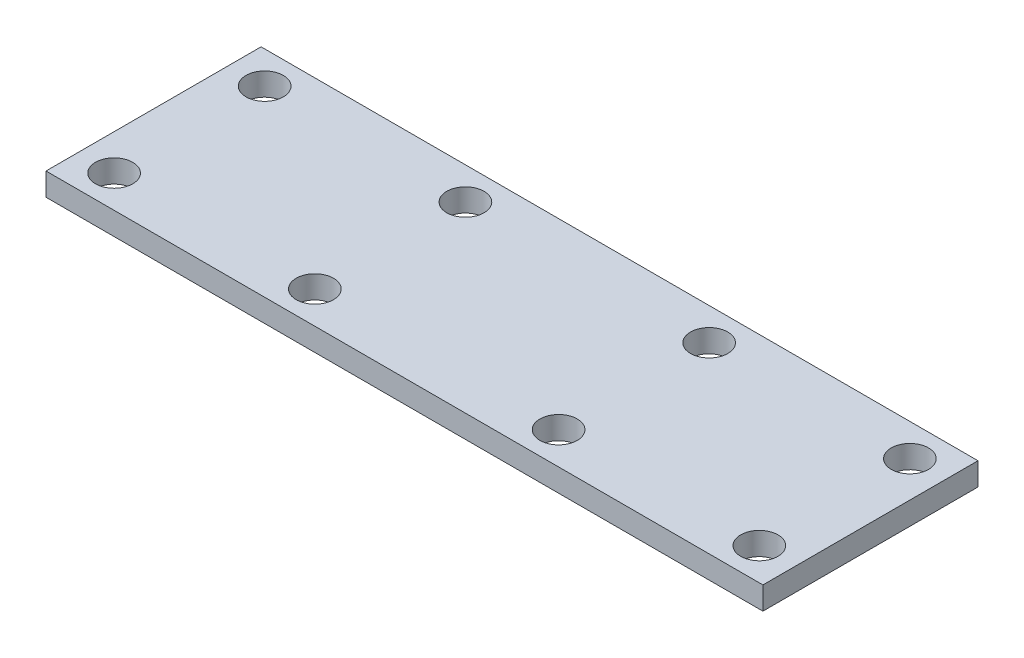
ISO-10303-21;
HEADER;
FILE_DESCRIPTION(('STEP AP214'),'2;1');
FILE_NAME('part.step','',(''),(''),'','','');
FILE_SCHEMA(('AUTOMOTIVE_DESIGN { 1 0 10303 214 1 1 1 1 }'));
ENDSEC;
DATA;
#1=APPLICATION_CONTEXT('core data for automotive mechanical design processes');
#2=APPLICATION_PROTOCOL_DEFINITION('international standard','automotive_design',2000,#1);
#3=PRODUCT_CONTEXT('',#1,'mechanical');
#4=PRODUCT('Part','Part','',(#3));
#5=PRODUCT_RELATED_PRODUCT_CATEGORY('part','',(#4));
#6=PRODUCT_DEFINITION_FORMATION('','',#4);
#7=PRODUCT_DEFINITION_CONTEXT('part definition',#1,'design');
#8=PRODUCT_DEFINITION('design','',#6,#7);
#9=PRODUCT_DEFINITION_SHAPE('','',#8);
#10=(LENGTH_UNIT() NAMED_UNIT(*) SI_UNIT(.MILLI.,.METRE.));
#11=(NAMED_UNIT(*) PLANE_ANGLE_UNIT() SI_UNIT($,.RADIAN.));
#12=(NAMED_UNIT(*) SI_UNIT($,.STERADIAN.) SOLID_ANGLE_UNIT());
#13=UNCERTAINTY_MEASURE_WITH_UNIT(LENGTH_MEASURE(1.E-05),#10,'distance_accuracy_value','');
#14=(GEOMETRIC_REPRESENTATION_CONTEXT(3) GLOBAL_UNCERTAINTY_ASSIGNED_CONTEXT((#13)) GLOBAL_UNIT_ASSIGNED_CONTEXT((#10,
#11,#12)) REPRESENTATION_CONTEXT('',''));
#15=CARTESIAN_POINT('',(0.,0.,0.));
#16=DIRECTION('',(0.,0.,1.));
#17=DIRECTION('',(1.,0.,0.));
#18=AXIS2_PLACEMENT_3D('',#15,#16,#17);
#19=CARTESIAN_POINT('',(0.,3.175,0.));
#20=DIRECTION('',(0.,1.,0.));
#21=DIRECTION('',(0.,0.,1.));
#22=AXIS2_PLACEMENT_3D('',#19,#20,#21);
#23=PLANE('',#22);
#24=CARTESIAN_POINT('',(45.,3.175,10.5));
#25=DIRECTION('',(0.,1.,0.));
#26=DIRECTION('',(0.,0.,1.));
#27=AXIS2_PLACEMENT_3D('',#24,#25,#26);
#28=CIRCLE('',#27,2.6);
#29=CARTESIAN_POINT('',(45.,3.175,13.1));
#30=VERTEX_POINT('',#29);
#31=EDGE_CURVE('E145',#30,#30,#28,.T.);
#32=ORIENTED_EDGE('',*,*,#31,.F.);
#33=EDGE_LOOP('',(#32));
#34=FACE_BOUND('',#33,.T.);
#35=CARTESIAN_POINT('',(-45.,3.175,-10.5));
#36=DIRECTION('',(0.,1.,0.));
#37=DIRECTION('',(0.,0.,1.));
#38=AXIS2_PLACEMENT_3D('',#35,#36,#37);
#39=CIRCLE('',#38,2.6);
#40=CARTESIAN_POINT('',(-45.,3.175,-7.9));
#41=VERTEX_POINT('',#40);
#42=EDGE_CURVE('E133',#41,#41,#39,.T.);
#43=ORIENTED_EDGE('',*,*,#42,.F.);
#44=EDGE_LOOP('',(#43));
#45=FACE_BOUND('',#44,.T.);
#46=CARTESIAN_POINT('',(17.,3.175,10.5));
#47=DIRECTION('',(0.,1.,0.));
#48=DIRECTION('',(0.,0.,1.));
#49=AXIS2_PLACEMENT_3D('',#46,#47,#48);
#50=CIRCLE('',#49,2.6);
#51=CARTESIAN_POINT('',(17.,3.175,13.1));
#52=VERTEX_POINT('',#51);
#53=EDGE_CURVE('E121',#52,#52,#50,.T.);
#54=ORIENTED_EDGE('',*,*,#53,.F.);
#55=EDGE_LOOP('',(#54));
#56=FACE_BOUND('',#55,.T.);
#57=CARTESIAN_POINT('',(-17.,3.175,-10.5));
#58=DIRECTION('',(0.,1.,0.));
#59=DIRECTION('',(0.,0.,1.));
#60=AXIS2_PLACEMENT_3D('',#57,#58,#59);
#61=CIRCLE('',#60,2.6);
#62=CARTESIAN_POINT('',(-17.,3.175,-7.9));
#63=VERTEX_POINT('',#62);
#64=EDGE_CURVE('E100',#63,#63,#61,.T.);
#65=ORIENTED_EDGE('',*,*,#64,.F.);
#66=EDGE_LOOP('',(#65));
#67=FACE_BOUND('',#66,.T.);
#68=DIRECTION('',(0.,0.,1.));
#69=VECTOR('',#68,1.);
#70=CARTESIAN_POINT('',(-50.,3.175,15.));
#71=LINE('',#70,#69);
#72=CARTESIAN_POINT('',(-50.,3.175,-15.));
#73=VERTEX_POINT('',#72);
#74=CARTESIAN_POINT('',(-50.,3.175,15.));
#75=VERTEX_POINT('',#74);
#76=EDGE_CURVE('E85',#73,#75,#71,.T.);
#77=ORIENTED_EDGE('',*,*,#76,.T.);
#78=DIRECTION('',(1.,0.,0.));
#79=VECTOR('',#78,1.);
#80=CARTESIAN_POINT('',(50.,3.175,15.));
#81=LINE('',#80,#79);
#82=CARTESIAN_POINT('',(50.,3.175,15.));
#83=VERTEX_POINT('',#82);
#84=EDGE_CURVE('E80',#75,#83,#81,.T.);
#85=ORIENTED_EDGE('',*,*,#84,.T.);
#86=DIRECTION('',(0.,0.,-1.));
#87=VECTOR('',#86,1.);
#88=CARTESIAN_POINT('',(50.,3.175,15.));
#89=LINE('',#88,#87);
#90=CARTESIAN_POINT('',(50.,3.175,-15.));
#91=VERTEX_POINT('',#90);
#92=EDGE_CURVE('E83',#83,#91,#89,.T.);
#93=ORIENTED_EDGE('',*,*,#92,.T.);
#94=DIRECTION('',(-1.,0.,0.));
#95=VECTOR('',#94,1.);
#96=CARTESIAN_POINT('',(50.,3.175,-15.));
#97=LINE('',#96,#95);
#98=EDGE_CURVE('E50',#91,#73,#97,.T.);
#99=ORIENTED_EDGE('',*,*,#98,.T.);
#100=EDGE_LOOP('',(#77,#85,#93,#99));
#101=FACE_BOUND('',#100,.T.);
#102=CARTESIAN_POINT('',(17.,3.175,-10.5));
#103=DIRECTION('',(0.,1.,0.));
#104=DIRECTION('',(0.,0.,-1.));
#105=AXIS2_PLACEMENT_3D('',#102,#103,#104);
#106=CIRCLE('',#105,2.6);
#107=CARTESIAN_POINT('',(17.,3.175,-13.1));
#108=VERTEX_POINT('',#107);
#109=EDGE_CURVE('E115',#108,#108,#106,.T.);
#110=ORIENTED_EDGE('',*,*,#109,.F.);
#111=EDGE_LOOP('',(#110));
#112=FACE_BOUND('',#111,.T.);
#113=CARTESIAN_POINT('',(-17.,3.175,10.5));
#114=DIRECTION('',(0.,1.,0.));
#115=DIRECTION('',(0.,0.,-1.));
#116=AXIS2_PLACEMENT_3D('',#113,#114,#115);
#117=CIRCLE('',#116,2.6);
#118=CARTESIAN_POINT('',(-17.,3.175,7.9));
#119=VERTEX_POINT('',#118);
#120=EDGE_CURVE('E127',#119,#119,#117,.T.);
#121=ORIENTED_EDGE('',*,*,#120,.F.);
#122=EDGE_LOOP('',(#121));
#123=FACE_BOUND('',#122,.T.);
#124=CARTESIAN_POINT('',(45.,3.175,-10.5));
#125=DIRECTION('',(0.,1.,0.));
#126=DIRECTION('',(0.,0.,-1.));
#127=AXIS2_PLACEMENT_3D('',#124,#125,#126);
#128=CIRCLE('',#127,2.6);
#129=CARTESIAN_POINT('',(45.,3.175,-13.1));
#130=VERTEX_POINT('',#129);
#131=EDGE_CURVE('E139',#130,#130,#128,.T.);
#132=ORIENTED_EDGE('',*,*,#131,.F.);
#133=EDGE_LOOP('',(#132));
#134=FACE_BOUND('',#133,.T.);
#135=CARTESIAN_POINT('',(-45.,3.175,10.5));
#136=DIRECTION('',(0.,1.,0.));
#137=DIRECTION('',(0.,0.,-1.));
#138=AXIS2_PLACEMENT_3D('',#135,#136,#137);
#139=CIRCLE('',#138,2.6);
#140=CARTESIAN_POINT('',(-45.,3.175,7.90000000000002));
#141=VERTEX_POINT('',#140);
#142=EDGE_CURVE('E151',#141,#141,#139,.T.);
#143=ORIENTED_EDGE('',*,*,#142,.F.);
#144=EDGE_LOOP('',(#143));
#145=FACE_BOUND('',#144,.T.);
#146=ADVANCED_FACE('F33',(#34,#45,#56,#67,#101,#112,#123,#134,#145),#23,.T.);
#147=CARTESIAN_POINT('',(0.,0.,0.));
#148=DIRECTION('',(0.,1.,0.));
#149=DIRECTION('',(0.,0.,1.));
#150=AXIS2_PLACEMENT_3D('',#147,#148,#149);
#151=PLANE('',#150);
#152=CARTESIAN_POINT('',(45.,0.,10.5));
#153=DIRECTION('',(0.,1.,0.));
#154=DIRECTION('',(0.,0.,1.));
#155=AXIS2_PLACEMENT_3D('',#152,#153,#154);
#156=CIRCLE('',#155,2.6);
#157=CARTESIAN_POINT('',(45.,0.,13.1));
#158=VERTEX_POINT('',#157);
#159=EDGE_CURVE('E148',#158,#158,#156,.T.);
#160=ORIENTED_EDGE('',*,*,#159,.T.);
#161=EDGE_LOOP('',(#160));
#162=FACE_BOUND('',#161,.T.);
#163=CARTESIAN_POINT('',(-45.,0.,-10.5));
#164=DIRECTION('',(0.,1.,0.));
#165=DIRECTION('',(0.,0.,1.));
#166=AXIS2_PLACEMENT_3D('',#163,#164,#165);
#167=CIRCLE('',#166,2.6);
#168=CARTESIAN_POINT('',(-45.,0.,-7.9));
#169=VERTEX_POINT('',#168);
#170=EDGE_CURVE('E136',#169,#169,#167,.T.);
#171=ORIENTED_EDGE('',*,*,#170,.T.);
#172=EDGE_LOOP('',(#171));
#173=FACE_BOUND('',#172,.T.);
#174=CARTESIAN_POINT('',(17.,0.,10.5));
#175=DIRECTION('',(0.,1.,0.));
#176=DIRECTION('',(0.,0.,1.));
#177=AXIS2_PLACEMENT_3D('',#174,#175,#176);
#178=CIRCLE('',#177,2.6);
#179=CARTESIAN_POINT('',(17.,0.,13.1));
#180=VERTEX_POINT('',#179);
#181=EDGE_CURVE('E124',#180,#180,#178,.T.);
#182=ORIENTED_EDGE('',*,*,#181,.T.);
#183=EDGE_LOOP('',(#182));
#184=FACE_BOUND('',#183,.T.);
#185=CARTESIAN_POINT('',(-17.,0.,-10.5));
#186=DIRECTION('',(0.,1.,0.));
#187=DIRECTION('',(0.,0.,1.));
#188=AXIS2_PLACEMENT_3D('',#185,#186,#187);
#189=CIRCLE('',#188,2.6);
#190=CARTESIAN_POINT('',(-17.,0.,-7.9));
#191=VERTEX_POINT('',#190);
#192=EDGE_CURVE('E112',#191,#191,#189,.T.);
#193=ORIENTED_EDGE('',*,*,#192,.T.);
#194=EDGE_LOOP('',(#193));
#195=FACE_BOUND('',#194,.T.);
#196=DIRECTION('',(0.,0.,1.));
#197=VECTOR('',#196,1.);
#198=CARTESIAN_POINT('',(-50.,0.,15.));
#199=LINE('',#198,#197);
#200=CARTESIAN_POINT('',(-50.,0.,-15.));
#201=VERTEX_POINT('',#200);
#202=CARTESIAN_POINT('',(-50.,0.,15.));
#203=VERTEX_POINT('',#202);
#204=EDGE_CURVE('E97',#201,#203,#199,.T.);
#205=ORIENTED_EDGE('',*,*,#204,.F.);
#206=DIRECTION('',(-1.,0.,0.));
#207=VECTOR('',#206,1.);
#208=CARTESIAN_POINT('',(50.,0.,-15.));
#209=LINE('',#208,#207);
#210=CARTESIAN_POINT('',(50.,0.,-15.));
#211=VERTEX_POINT('',#210);
#212=EDGE_CURVE('E73',#211,#201,#209,.T.);
#213=ORIENTED_EDGE('',*,*,#212,.F.);
#214=DIRECTION('',(0.,0.,-1.));
#215=VECTOR('',#214,1.);
#216=CARTESIAN_POINT('',(50.,0.,15.));
#217=LINE('',#216,#215);
#218=CARTESIAN_POINT('',(50.,0.,15.));
#219=VERTEX_POINT('',#218);
#220=EDGE_CURVE('E67',#219,#211,#217,.T.);
#221=ORIENTED_EDGE('',*,*,#220,.F.);
#222=DIRECTION('',(1.,0.,0.));
#223=VECTOR('',#222,1.);
#224=CARTESIAN_POINT('',(50.,0.,15.));
#225=LINE('',#224,#223);
#226=EDGE_CURVE('E89',#203,#219,#225,.T.);
#227=ORIENTED_EDGE('',*,*,#226,.F.);
#228=EDGE_LOOP('',(#205,#213,#221,#227));
#229=FACE_BOUND('',#228,.T.);
#230=CARTESIAN_POINT('',(17.,0.,-10.5));
#231=DIRECTION('',(0.,1.,0.));
#232=DIRECTION('',(0.,0.,-1.));
#233=AXIS2_PLACEMENT_3D('',#230,#231,#232);
#234=CIRCLE('',#233,2.6);
#235=CARTESIAN_POINT('',(17.,0.,-13.1));
#236=VERTEX_POINT('',#235);
#237=EDGE_CURVE('E118',#236,#236,#234,.T.);
#238=ORIENTED_EDGE('',*,*,#237,.T.);
#239=EDGE_LOOP('',(#238));
#240=FACE_BOUND('',#239,.T.);
#241=CARTESIAN_POINT('',(-17.,0.,10.5));
#242=DIRECTION('',(0.,1.,0.));
#243=DIRECTION('',(0.,0.,-1.));
#244=AXIS2_PLACEMENT_3D('',#241,#242,#243);
#245=CIRCLE('',#244,2.6);
#246=CARTESIAN_POINT('',(-17.,0.,7.9));
#247=VERTEX_POINT('',#246);
#248=EDGE_CURVE('E130',#247,#247,#245,.T.);
#249=ORIENTED_EDGE('',*,*,#248,.T.);
#250=EDGE_LOOP('',(#249));
#251=FACE_BOUND('',#250,.T.);
#252=CARTESIAN_POINT('',(45.,0.,-10.5));
#253=DIRECTION('',(0.,1.,0.));
#254=DIRECTION('',(0.,0.,-1.));
#255=AXIS2_PLACEMENT_3D('',#252,#253,#254);
#256=CIRCLE('',#255,2.6);
#257=CARTESIAN_POINT('',(45.,0.,-13.1));
#258=VERTEX_POINT('',#257);
#259=EDGE_CURVE('E142',#258,#258,#256,.T.);
#260=ORIENTED_EDGE('',*,*,#259,.T.);
#261=EDGE_LOOP('',(#260));
#262=FACE_BOUND('',#261,.T.);
#263=CARTESIAN_POINT('',(-45.,0.,10.5));
#264=DIRECTION('',(0.,1.,0.));
#265=DIRECTION('',(0.,0.,-1.));
#266=AXIS2_PLACEMENT_3D('',#263,#264,#265);
#267=CIRCLE('',#266,2.6);
#268=CARTESIAN_POINT('',(-45.,0.,7.90000000000002));
#269=VERTEX_POINT('',#268);
#270=EDGE_CURVE('E154',#269,#269,#267,.T.);
#271=ORIENTED_EDGE('',*,*,#270,.T.);
#272=EDGE_LOOP('',(#271));
#273=FACE_BOUND('',#272,.T.);
#274=ADVANCED_FACE('F108',(#162,#173,#184,#195,#229,#240,#251,#262,#273),#151,.F.);
#275=CARTESIAN_POINT('',(-50.,3.175,15.));
#276=DIRECTION('',(1.,0.,0.));
#277=DIRECTION('',(0.,0.,-1.));
#278=AXIS2_PLACEMENT_3D('',#275,#276,#277);
#279=PLANE('',#278);
#280=ORIENTED_EDGE('',*,*,#204,.T.);
#281=DIRECTION('',(0.,-1.,0.));
#282=VECTOR('',#281,1.);
#283=CARTESIAN_POINT('',(-50.,3.175,15.));
#284=LINE('',#283,#282);
#285=EDGE_CURVE('E11',#75,#203,#284,.T.);
#286=ORIENTED_EDGE('',*,*,#285,.F.);
#287=ORIENTED_EDGE('',*,*,#76,.F.);
#288=DIRECTION('',(0.,-1.,0.));
#289=VECTOR('',#288,1.);
#290=CARTESIAN_POINT('',(-50.,3.175,-15.));
#291=LINE('',#290,#289);
#292=EDGE_CURVE('E93',#73,#201,#291,.T.);
#293=ORIENTED_EDGE('',*,*,#292,.T.);
#294=EDGE_LOOP('',(#280,#286,#287,#293));
#295=FACE_BOUND('',#294,.T.);
#296=ADVANCED_FACE('F35',(#295),#279,.F.);
#297=CARTESIAN_POINT('',(50.,3.175,15.));
#298=DIRECTION('',(0.,0.,-1.));
#299=DIRECTION('',(-1.,0.,0.));
#300=AXIS2_PLACEMENT_3D('',#297,#298,#299);
#301=PLANE('',#300);
#302=ORIENTED_EDGE('',*,*,#226,.T.);
#303=DIRECTION('',(0.,-1.,0.));
#304=VECTOR('',#303,1.);
#305=CARTESIAN_POINT('',(50.,3.175,15.));
#306=LINE('',#305,#304);
#307=EDGE_CURVE('E42',#83,#219,#306,.T.);
#308=ORIENTED_EDGE('',*,*,#307,.F.);
#309=ORIENTED_EDGE('',*,*,#84,.F.);
#310=ORIENTED_EDGE('',*,*,#285,.T.);
#311=EDGE_LOOP('',(#302,#308,#309,#310));
#312=FACE_BOUND('',#311,.T.);
#313=ADVANCED_FACE('F88',(#312),#301,.F.);
#314=CARTESIAN_POINT('',(50.,3.175,15.));
#315=DIRECTION('',(-1.,0.,0.));
#316=DIRECTION('',(0.,0.,1.));
#317=AXIS2_PLACEMENT_3D('',#314,#315,#316);
#318=PLANE('',#317);
#319=ORIENTED_EDGE('',*,*,#220,.T.);
#320=DIRECTION('',(0.,-1.,0.));
#321=VECTOR('',#320,1.);
#322=CARTESIAN_POINT('',(50.,3.175,-15.));
#323=LINE('',#322,#321);
#324=EDGE_CURVE('E90',#91,#211,#323,.T.);
#325=ORIENTED_EDGE('',*,*,#324,.F.);
#326=ORIENTED_EDGE('',*,*,#92,.F.);
#327=ORIENTED_EDGE('',*,*,#307,.T.);
#328=EDGE_LOOP('',(#319,#325,#326,#327));
#329=FACE_BOUND('',#328,.T.);
#330=ADVANCED_FACE('F91',(#329),#318,.F.);
#331=CARTESIAN_POINT('',(50.,3.175,-15.));
#332=DIRECTION('',(0.,0.,1.));
#333=DIRECTION('',(1.,0.,0.));
#334=AXIS2_PLACEMENT_3D('',#331,#332,#333);
#335=PLANE('',#334);
#336=ORIENTED_EDGE('',*,*,#212,.T.);
#337=ORIENTED_EDGE('',*,*,#292,.F.);
#338=ORIENTED_EDGE('',*,*,#98,.F.);
#339=ORIENTED_EDGE('',*,*,#324,.T.);
#340=EDGE_LOOP('',(#336,#337,#338,#339));
#341=FACE_BOUND('',#340,.T.);
#342=ADVANCED_FACE('F105',(#341),#335,.F.);
#343=CARTESIAN_POINT('',(-17.,3.175,-10.5));
#344=DIRECTION('',(0.,-1.,0.));
#345=DIRECTION('',(0.,0.,-1.));
#346=AXIS2_PLACEMENT_3D('',#343,#344,#345);
#347=CYLINDRICAL_SURFACE('',#346,2.6);
#348=ORIENTED_EDGE('',*,*,#64,.T.);
#349=EDGE_LOOP('',(#348));
#350=FACE_BOUND('',#349,.T.);
#351=ORIENTED_EDGE('',*,*,#192,.F.);
#352=EDGE_LOOP('',(#351));
#353=FACE_BOUND('',#352,.T.);
#354=ADVANCED_FACE('F174',(#350,#353),#347,.F.);
#355=CARTESIAN_POINT('',(17.,3.175,-10.5));
#356=DIRECTION('',(0.,-1.,0.));
#357=DIRECTION('',(0.,0.,-1.));
#358=AXIS2_PLACEMENT_3D('',#355,#356,#357);
#359=CYLINDRICAL_SURFACE('',#358,2.6);
#360=ORIENTED_EDGE('',*,*,#109,.T.);
#361=EDGE_LOOP('',(#360));
#362=FACE_BOUND('',#361,.T.);
#363=ORIENTED_EDGE('',*,*,#237,.F.);
#364=EDGE_LOOP('',(#363));
#365=FACE_BOUND('',#364,.T.);
#366=ADVANCED_FACE('F220',(#362,#365),#359,.F.);
#367=CARTESIAN_POINT('',(17.,3.175,10.5));
#368=DIRECTION('',(0.,-1.,0.));
#369=DIRECTION('',(0.,0.,-1.));
#370=AXIS2_PLACEMENT_3D('',#367,#368,#369);
#371=CYLINDRICAL_SURFACE('',#370,2.6);
#372=ORIENTED_EDGE('',*,*,#53,.T.);
#373=EDGE_LOOP('',(#372));
#374=FACE_BOUND('',#373,.T.);
#375=ORIENTED_EDGE('',*,*,#181,.F.);
#376=EDGE_LOOP('',(#375));
#377=FACE_BOUND('',#376,.T.);
#378=ADVANCED_FACE('F228',(#374,#377),#371,.F.);
#379=CARTESIAN_POINT('',(-17.,3.175,10.5));
#380=DIRECTION('',(0.,-1.,0.));
#381=DIRECTION('',(0.,0.,-1.));
#382=AXIS2_PLACEMENT_3D('',#379,#380,#381);
#383=CYLINDRICAL_SURFACE('',#382,2.6);
#384=ORIENTED_EDGE('',*,*,#120,.T.);
#385=EDGE_LOOP('',(#384));
#386=FACE_BOUND('',#385,.T.);
#387=ORIENTED_EDGE('',*,*,#248,.F.);
#388=EDGE_LOOP('',(#387));
#389=FACE_BOUND('',#388,.T.);
#390=ADVANCED_FACE('F236',(#386,#389),#383,.F.);
#391=CARTESIAN_POINT('',(-45.,3.175,-10.5));
#392=DIRECTION('',(0.,-1.,0.));
#393=DIRECTION('',(0.,0.,-1.));
#394=AXIS2_PLACEMENT_3D('',#391,#392,#393);
#395=CYLINDRICAL_SURFACE('',#394,2.6);
#396=ORIENTED_EDGE('',*,*,#42,.T.);
#397=EDGE_LOOP('',(#396));
#398=FACE_BOUND('',#397,.T.);
#399=ORIENTED_EDGE('',*,*,#170,.F.);
#400=EDGE_LOOP('',(#399));
#401=FACE_BOUND('',#400,.T.);
#402=ADVANCED_FACE('F245',(#398,#401),#395,.F.);
#403=CARTESIAN_POINT('',(45.,3.175,-10.5));
#404=DIRECTION('',(0.,-1.,0.));
#405=DIRECTION('',(0.,0.,-1.));
#406=AXIS2_PLACEMENT_3D('',#403,#404,#405);
#407=CYLINDRICAL_SURFACE('',#406,2.6);
#408=ORIENTED_EDGE('',*,*,#131,.T.);
#409=EDGE_LOOP('',(#408));
#410=FACE_BOUND('',#409,.T.);
#411=ORIENTED_EDGE('',*,*,#259,.F.);
#412=EDGE_LOOP('',(#411));
#413=FACE_BOUND('',#412,.T.);
#414=ADVANCED_FACE('F254',(#410,#413),#407,.F.);
#415=CARTESIAN_POINT('',(45.,3.175,10.5));
#416=DIRECTION('',(0.,-1.,0.));
#417=DIRECTION('',(0.,0.,-1.));
#418=AXIS2_PLACEMENT_3D('',#415,#416,#417);
#419=CYLINDRICAL_SURFACE('',#418,2.6);
#420=ORIENTED_EDGE('',*,*,#31,.T.);
#421=EDGE_LOOP('',(#420));
#422=FACE_BOUND('',#421,.T.);
#423=ORIENTED_EDGE('',*,*,#159,.F.);
#424=EDGE_LOOP('',(#423));
#425=FACE_BOUND('',#424,.T.);
#426=ADVANCED_FACE('F263',(#422,#425),#419,.F.);
#427=CARTESIAN_POINT('',(-45.,3.175,10.5));
#428=DIRECTION('',(0.,-1.,0.));
#429=DIRECTION('',(0.,0.,-1.));
#430=AXIS2_PLACEMENT_3D('',#427,#428,#429);
#431=CYLINDRICAL_SURFACE('',#430,2.6);
#432=ORIENTED_EDGE('',*,*,#142,.T.);
#433=EDGE_LOOP('',(#432));
#434=FACE_BOUND('',#433,.T.);
#435=ORIENTED_EDGE('',*,*,#270,.F.);
#436=EDGE_LOOP('',(#435));
#437=FACE_BOUND('',#436,.T.);
#438=ADVANCED_FACE('F160',(#434,#437),#431,.F.);
#439=CLOSED_SHELL('',(#146,#274,#296,#313,#330,#342,#354,#366,#378,#390,#402,#414,#426,#438));
#440=MANIFOLD_SOLID_BREP('B2',#439);
#441=ADVANCED_BREP_SHAPE_REPRESENTATION('',(#18,#440),#14);
#442=SHAPE_DEFINITION_REPRESENTATION(#9,#441);
ENDSEC;
END-ISO-10303-21;
